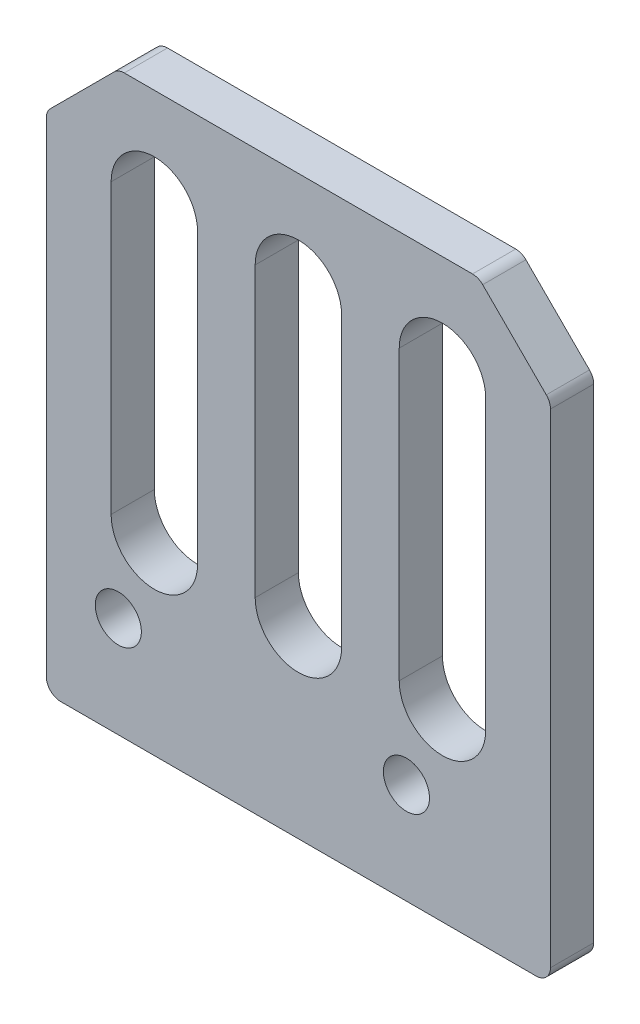
ISO-10303-21;
HEADER;
FILE_DESCRIPTION(('STEP AP214'),'2;1');
FILE_NAME('part.step','',(''),(''),'','','');
FILE_SCHEMA(('AUTOMOTIVE_DESIGN { 1 0 10303 214 1 1 1 1 }'));
ENDSEC;
DATA;
#1=APPLICATION_CONTEXT('core data for automotive mechanical design processes');
#2=APPLICATION_PROTOCOL_DEFINITION('international standard','automotive_design',2000,#1);
#3=PRODUCT_CONTEXT('',#1,'mechanical');
#4=PRODUCT('Part','Part','',(#3));
#5=PRODUCT_RELATED_PRODUCT_CATEGORY('part','',(#4));
#6=PRODUCT_DEFINITION_FORMATION('','',#4);
#7=PRODUCT_DEFINITION_CONTEXT('part definition',#1,'design');
#8=PRODUCT_DEFINITION('design','',#6,#7);
#9=PRODUCT_DEFINITION_SHAPE('','',#8);
#10=(LENGTH_UNIT() NAMED_UNIT(*) SI_UNIT(.MILLI.,.METRE.));
#11=(NAMED_UNIT(*) PLANE_ANGLE_UNIT() SI_UNIT($,.RADIAN.));
#12=(NAMED_UNIT(*) SI_UNIT($,.STERADIAN.) SOLID_ANGLE_UNIT());
#13=UNCERTAINTY_MEASURE_WITH_UNIT(LENGTH_MEASURE(1.E-05),#10,'distance_accuracy_value','');
#14=(GEOMETRIC_REPRESENTATION_CONTEXT(3) GLOBAL_UNCERTAINTY_ASSIGNED_CONTEXT((#13)) GLOBAL_UNIT_ASSIGNED_CONTEXT((#10,
#11,#12)) REPRESENTATION_CONTEXT('',''));
#15=CARTESIAN_POINT('',(0.,0.,0.));
#16=DIRECTION('',(0.,0.,1.));
#17=DIRECTION('',(1.,0.,0.));
#18=AXIS2_PLACEMENT_3D('',#15,#16,#17);
#19=CARTESIAN_POINT('',(17.5,20.,3.));
#20=DIRECTION('',(-1.,0.,0.));
#21=DIRECTION('',(0.,-1.,0.));
#22=AXIS2_PLACEMENT_3D('',#19,#20,#21);
#23=PLANE('',#22);
#24=DIRECTION('',(0.,1.,0.));
#25=VECTOR('',#24,1.);
#26=CARTESIAN_POINT('',(17.5,20.,0.));
#27=LINE('',#26,#25);
#28=CARTESIAN_POINT('',(17.5,-19.,0.));
#29=VERTEX_POINT('',#28);
#30=CARTESIAN_POINT('',(17.5,14.5857864376269,0.));
#31=VERTEX_POINT('',#30);
#32=EDGE_CURVE('E344',#29,#31,#27,.T.);
#33=ORIENTED_EDGE('',*,*,#32,.T.);
#34=DIRECTION('',(0.,0.,-1.));
#35=VECTOR('',#34,1.);
#36=CARTESIAN_POINT('',(17.5,14.5857864376269,3.));
#37=LINE('',#36,#35);
#38=CARTESIAN_POINT('',(17.5,14.5857864376269,3.));
#39=VERTEX_POINT('',#38);
#40=EDGE_CURVE('E457',#31,#39,#37,.F.);
#41=ORIENTED_EDGE('',*,*,#40,.T.);
#42=DIRECTION('',(0.,1.,0.));
#43=VECTOR('',#42,1.);
#44=CARTESIAN_POINT('',(17.5,20.,3.));
#45=LINE('',#44,#43);
#46=CARTESIAN_POINT('',(17.5,-19.,3.));
#47=VERTEX_POINT('',#46);
#48=EDGE_CURVE('E356',#47,#39,#45,.T.);
#49=ORIENTED_EDGE('',*,*,#48,.F.);
#50=DIRECTION('',(0.,0.,-1.));
#51=VECTOR('',#50,1.);
#52=CARTESIAN_POINT('',(17.5,-19.,3.));
#53=LINE('',#52,#51);
#54=EDGE_CURVE('E453',#47,#29,#53,.T.);
#55=ORIENTED_EDGE('',*,*,#54,.T.);
#56=EDGE_LOOP('',(#33,#41,#49,#55));
#57=FACE_BOUND('',#56,.T.);
#58=ADVANCED_FACE('F40',(#57),#23,.F.);
#59=CARTESIAN_POINT('',(-17.5,20.,3.));
#60=DIRECTION('',(0.,-1.,0.));
#61=DIRECTION('',(0.,0.,-1.));
#62=AXIS2_PLACEMENT_3D('',#59,#60,#61);
#63=PLANE('',#62);
#64=DIRECTION('',(-1.,0.,0.));
#65=VECTOR('',#64,1.);
#66=CARTESIAN_POINT('',(-17.5,20.,3.));
#67=LINE('',#66,#65);
#68=CARTESIAN_POINT('',(12.0857864376269,20.,3.));
#69=VERTEX_POINT('',#68);
#70=CARTESIAN_POINT('',(-12.0857864376269,20.,3.));
#71=VERTEX_POINT('',#70);
#72=EDGE_CURVE('E360',#69,#71,#67,.T.);
#73=ORIENTED_EDGE('',*,*,#72,.F.);
#74=DIRECTION('',(0.,0.,1.));
#75=VECTOR('',#74,1.);
#76=CARTESIAN_POINT('',(12.0857864376269,20.,0.));
#77=LINE('',#76,#75);
#78=CARTESIAN_POINT('',(12.0857864376269,20.,0.));
#79=VERTEX_POINT('',#78);
#80=EDGE_CURVE('E407',#69,#79,#77,.F.);
#81=ORIENTED_EDGE('',*,*,#80,.T.);
#82=DIRECTION('',(-1.,0.,0.));
#83=VECTOR('',#82,1.);
#84=CARTESIAN_POINT('',(-17.5,20.,0.));
#85=LINE('',#84,#83);
#86=CARTESIAN_POINT('',(-12.0857864376269,20.,0.));
#87=VERTEX_POINT('',#86);
#88=EDGE_CURVE('E377',#79,#87,#85,.T.);
#89=ORIENTED_EDGE('',*,*,#88,.T.);
#90=DIRECTION('',(0.,0.,-1.));
#91=VECTOR('',#90,1.);
#92=CARTESIAN_POINT('',(-12.0857864376269,20.,3.));
#93=LINE('',#92,#91);
#94=EDGE_CURVE('E403',#87,#71,#93,.F.);
#95=ORIENTED_EDGE('',*,*,#94,.T.);
#96=EDGE_LOOP('',(#73,#81,#89,#95));
#97=FACE_BOUND('',#96,.T.);
#98=ADVANCED_FACE('F491',(#97),#63,.F.);
#99=CARTESIAN_POINT('',(-17.5,20.,3.));
#100=DIRECTION('',(1.,0.,0.));
#101=DIRECTION('',(0.,1.,0.));
#102=AXIS2_PLACEMENT_3D('',#99,#100,#101);
#103=PLANE('',#102);
#104=DIRECTION('',(0.,-1.,0.));
#105=VECTOR('',#104,1.);
#106=CARTESIAN_POINT('',(-17.5,20.,3.));
#107=LINE('',#106,#105);
#108=CARTESIAN_POINT('',(-17.5,14.5857864376269,3.));
#109=VERTEX_POINT('',#108);
#110=CARTESIAN_POINT('',(-17.5,-19.,3.));
#111=VERTEX_POINT('',#110);
#112=EDGE_CURVE('E365',#109,#111,#107,.T.);
#113=ORIENTED_EDGE('',*,*,#112,.F.);
#114=DIRECTION('',(0.,0.,1.));
#115=VECTOR('',#114,1.);
#116=CARTESIAN_POINT('',(-17.5,14.5857864376269,0.));
#117=LINE('',#116,#115);
#118=CARTESIAN_POINT('',(-17.5,14.5857864376269,0.));
#119=VERTEX_POINT('',#118);
#120=EDGE_CURVE('E471',#109,#119,#117,.F.);
#121=ORIENTED_EDGE('',*,*,#120,.T.);
#122=DIRECTION('',(0.,-1.,0.));
#123=VECTOR('',#122,1.);
#124=CARTESIAN_POINT('',(-17.5,20.,0.));
#125=LINE('',#124,#123);
#126=CARTESIAN_POINT('',(-17.5,-19.,0.));
#127=VERTEX_POINT('',#126);
#128=EDGE_CURVE('E381',#119,#127,#125,.T.);
#129=ORIENTED_EDGE('',*,*,#128,.T.);
#130=DIRECTION('',(0.,0.,-1.));
#131=VECTOR('',#130,1.);
#132=CARTESIAN_POINT('',(-17.5,-19.,3.));
#133=LINE('',#132,#131);
#134=EDGE_CURVE('E468',#127,#111,#133,.F.);
#135=ORIENTED_EDGE('',*,*,#134,.T.);
#136=EDGE_LOOP('',(#113,#121,#129,#135));
#137=FACE_BOUND('',#136,.T.);
#138=ADVANCED_FACE('F526',(#137),#103,.F.);
#139=CARTESIAN_POINT('',(-17.5,-20.,3.));
#140=DIRECTION('',(0.,1.,0.));
#141=DIRECTION('',(0.,0.,1.));
#142=AXIS2_PLACEMENT_3D('',#139,#140,#141);
#143=PLANE('',#142);
#144=DIRECTION('',(1.,0.,0.));
#145=VECTOR('',#144,1.);
#146=CARTESIAN_POINT('',(-17.5,-20.,0.));
#147=LINE('',#146,#145);
#148=CARTESIAN_POINT('',(-16.5,-20.,0.));
#149=VERTEX_POINT('',#148);
#150=CARTESIAN_POINT('',(16.5,-20.,0.));
#151=VERTEX_POINT('',#150);
#152=EDGE_CURVE('E361',#149,#151,#147,.T.);
#153=ORIENTED_EDGE('',*,*,#152,.T.);
#154=DIRECTION('',(0.,0.,-1.));
#155=VECTOR('',#154,1.);
#156=CARTESIAN_POINT('',(16.5,-20.,3.));
#157=LINE('',#156,#155);
#158=CARTESIAN_POINT('',(16.5,-20.,3.));
#159=VERTEX_POINT('',#158);
#160=EDGE_CURVE('E465',#151,#159,#157,.F.);
#161=ORIENTED_EDGE('',*,*,#160,.T.);
#162=DIRECTION('',(1.,0.,0.));
#163=VECTOR('',#162,1.);
#164=CARTESIAN_POINT('',(-17.5,-20.,3.));
#165=LINE('',#164,#163);
#166=CARTESIAN_POINT('',(-16.5,-20.,3.));
#167=VERTEX_POINT('',#166);
#168=EDGE_CURVE('E369',#167,#159,#165,.T.);
#169=ORIENTED_EDGE('',*,*,#168,.F.);
#170=DIRECTION('',(0.,0.,-1.));
#171=VECTOR('',#170,1.);
#172=CARTESIAN_POINT('',(-16.5,-20.,3.));
#173=LINE('',#172,#171);
#174=EDGE_CURVE('E461',#167,#149,#173,.T.);
#175=ORIENTED_EDGE('',*,*,#174,.T.);
#176=EDGE_LOOP('',(#153,#161,#169,#175));
#177=FACE_BOUND('',#176,.T.);
#178=ADVANCED_FACE('F518',(#177),#143,.F.);
#179=CARTESIAN_POINT('',(0.,0.,3.));
#180=DIRECTION('',(0.,0.,1.));
#181=DIRECTION('',(1.,0.,0.));
#182=AXIS2_PLACEMENT_3D('',#179,#180,#181);
#183=PLANE('',#182);
#184=CARTESIAN_POINT('',(10.,13.,3.));
#185=DIRECTION('',(0.,0.,1.));
#186=DIRECTION('',(1.,0.,0.));
#187=AXIS2_PLACEMENT_3D('',#184,#185,#186);
#188=CIRCLE('',#187,3.00000000000001);
#189=CARTESIAN_POINT('',(13.,13.,3.));
#190=VERTEX_POINT('',#189);
#191=CARTESIAN_POINT('',(6.99999999999999,13.,3.));
#192=VERTEX_POINT('',#191);
#193=EDGE_CURVE('E56',#190,#192,#188,.T.);
#194=ORIENTED_EDGE('',*,*,#193,.F.);
#195=DIRECTION('',(0.,1.,0.));
#196=VECTOR('',#195,1.);
#197=CARTESIAN_POINT('',(13.,13.,3.));
#198=LINE('',#197,#196);
#199=CARTESIAN_POINT('',(13.,-7.,3.));
#200=VERTEX_POINT('',#199);
#201=EDGE_CURVE('E260',#200,#190,#198,.T.);
#202=ORIENTED_EDGE('',*,*,#201,.F.);
#203=CARTESIAN_POINT('',(10.,-7.,3.));
#204=DIRECTION('',(0.,0.,1.));
#205=DIRECTION('',(1.,0.,0.));
#206=AXIS2_PLACEMENT_3D('',#203,#204,#205);
#207=CIRCLE('',#206,3.00000000000001);
#208=CARTESIAN_POINT('',(6.99999999999999,-7.,3.));
#209=VERTEX_POINT('',#208);
#210=EDGE_CURVE('E279',#209,#200,#207,.T.);
#211=ORIENTED_EDGE('',*,*,#210,.F.);
#212=DIRECTION('',(0.,-1.,0.));
#213=VECTOR('',#212,1.);
#214=CARTESIAN_POINT('',(6.99999999999999,13.,3.));
#215=LINE('',#214,#213);
#216=EDGE_CURVE('E275',#192,#209,#215,.T.);
#217=ORIENTED_EDGE('',*,*,#216,.F.);
#218=EDGE_LOOP('',(#194,#202,#211,#217));
#219=FACE_BOUND('',#218,.T.);
#220=CARTESIAN_POINT('',(-10.,13.,3.));
#221=DIRECTION('',(0.,0.,1.));
#222=DIRECTION('',(1.,0.,0.));
#223=AXIS2_PLACEMENT_3D('',#220,#221,#222);
#224=CIRCLE('',#223,3.);
#225=CARTESIAN_POINT('',(-7.,13.,3.));
#226=VERTEX_POINT('',#225);
#227=CARTESIAN_POINT('',(-13.,13.,3.));
#228=VERTEX_POINT('',#227);
#229=EDGE_CURVE('E64',#226,#228,#224,.T.);
#230=ORIENTED_EDGE('',*,*,#229,.F.);
#231=DIRECTION('',(0.,1.,0.));
#232=VECTOR('',#231,1.);
#233=CARTESIAN_POINT('',(-7.,13.,3.));
#234=LINE('',#233,#232);
#235=CARTESIAN_POINT('',(-7.,-7.,3.));
#236=VERTEX_POINT('',#235);
#237=EDGE_CURVE('E225',#236,#226,#234,.T.);
#238=ORIENTED_EDGE('',*,*,#237,.F.);
#239=CARTESIAN_POINT('',(-10.,-7.,3.));
#240=DIRECTION('',(0.,0.,1.));
#241=DIRECTION('',(1.,0.,0.));
#242=AXIS2_PLACEMENT_3D('',#239,#240,#241);
#243=CIRCLE('',#242,3.);
#244=CARTESIAN_POINT('',(-13.,-7.,3.));
#245=VERTEX_POINT('',#244);
#246=EDGE_CURVE('E230',#245,#236,#243,.T.);
#247=ORIENTED_EDGE('',*,*,#246,.F.);
#248=DIRECTION('',(0.,-1.,0.));
#249=VECTOR('',#248,1.);
#250=CARTESIAN_POINT('',(-13.,13.,3.));
#251=LINE('',#250,#249);
#252=EDGE_CURVE('E239',#228,#245,#251,.T.);
#253=ORIENTED_EDGE('',*,*,#252,.F.);
#254=EDGE_LOOP('',(#230,#238,#247,#253));
#255=FACE_BOUND('',#254,.T.);
#256=CARTESIAN_POINT('',(0.,13.,3.));
#257=DIRECTION('',(0.,0.,1.));
#258=DIRECTION('',(1.,0.,0.));
#259=AXIS2_PLACEMENT_3D('',#256,#257,#258);
#260=CIRCLE('',#259,3.);
#261=CARTESIAN_POINT('',(3.,13.,3.));
#262=VERTEX_POINT('',#261);
#263=CARTESIAN_POINT('',(-3.,13.,3.));
#264=VERTEX_POINT('',#263);
#265=EDGE_CURVE('E249',#262,#264,#260,.T.);
#266=ORIENTED_EDGE('',*,*,#265,.F.);
#267=DIRECTION('',(0.,1.,0.));
#268=VECTOR('',#267,1.);
#269=CARTESIAN_POINT('',(3.,13.,3.));
#270=LINE('',#269,#268);
#271=CARTESIAN_POINT('',(3.,-7.,3.));
#272=VERTEX_POINT('',#271);
#273=EDGE_CURVE('E301',#272,#262,#270,.T.);
#274=ORIENTED_EDGE('',*,*,#273,.F.);
#275=CARTESIAN_POINT('',(0.,-7.,3.));
#276=DIRECTION('',(0.,0.,1.));
#277=DIRECTION('',(1.,0.,0.));
#278=AXIS2_PLACEMENT_3D('',#275,#276,#277);
#279=CIRCLE('',#278,3.);
#280=CARTESIAN_POINT('',(-3.,-7.,3.));
#281=VERTEX_POINT('',#280);
#282=EDGE_CURVE('E320',#281,#272,#279,.T.);
#283=ORIENTED_EDGE('',*,*,#282,.F.);
#284=DIRECTION('',(0.,-1.,0.));
#285=VECTOR('',#284,1.);
#286=CARTESIAN_POINT('',(-3.,13.,3.));
#287=LINE('',#286,#285);
#288=EDGE_CURVE('E316',#264,#281,#287,.T.);
#289=ORIENTED_EDGE('',*,*,#288,.F.);
#290=EDGE_LOOP('',(#266,#274,#283,#289));
#291=FACE_BOUND('',#290,.T.);
#292=CARTESIAN_POINT('',(-12.5,-13.,3.));
#293=DIRECTION('',(0.,0.,1.));
#294=DIRECTION('',(1.,0.,0.));
#295=AXIS2_PLACEMENT_3D('',#292,#293,#294);
#296=CIRCLE('',#295,1.6);
#297=CARTESIAN_POINT('',(-10.9,-13.,3.));
#298=VERTEX_POINT('',#297);
#299=EDGE_CURVE('E345',#298,#298,#296,.T.);
#300=ORIENTED_EDGE('',*,*,#299,.F.);
#301=EDGE_LOOP('',(#300));
#302=FACE_BOUND('',#301,.T.);
#303=CARTESIAN_POINT('',(7.5,-13.,3.));
#304=DIRECTION('',(0.,0.,1.));
#305=DIRECTION('',(1.,0.,0.));
#306=AXIS2_PLACEMENT_3D('',#303,#304,#305);
#307=CIRCLE('',#306,1.6);
#308=CARTESIAN_POINT('',(9.1,-13.,3.));
#309=VERTEX_POINT('',#308);
#310=EDGE_CURVE('E330',#309,#309,#307,.T.);
#311=ORIENTED_EDGE('',*,*,#310,.F.);
#312=EDGE_LOOP('',(#311));
#313=FACE_BOUND('',#312,.T.);
#314=DIRECTION('',(0.707106781186546,-0.707106781186549,0.));
#315=VECTOR('',#314,1.);
#316=CARTESIAN_POINT('',(16.25,16.25,3.));
#317=LINE('',#316,#315);
#318=CARTESIAN_POINT('',(17.2071067811865,15.2928932188134,3.));
#319=VERTEX_POINT('',#318);
#320=CARTESIAN_POINT('',(12.7928932188135,19.7071067811865,3.));
#321=VERTEX_POINT('',#320);
#322=EDGE_CURVE('E395',#319,#321,#317,.F.);
#323=ORIENTED_EDGE('',*,*,#322,.T.);
#324=CARTESIAN_POINT('',(12.0857864376269,19.,3.));
#325=DIRECTION('',(0.,0.,1.));
#326=DIRECTION('',(1.,0.,0.));
#327=AXIS2_PLACEMENT_3D('',#324,#325,#326);
#328=CIRCLE('',#327,1.);
#329=EDGE_CURVE('E450',#321,#69,#328,.T.);
#330=ORIENTED_EDGE('',*,*,#329,.T.);
#331=ORIENTED_EDGE('',*,*,#72,.T.);
#332=CARTESIAN_POINT('',(-12.0857864376269,19.,3.));
#333=DIRECTION('',(0.,0.,1.));
#334=DIRECTION('',(1.,0.,0.));
#335=AXIS2_PLACEMENT_3D('',#332,#333,#334);
#336=CIRCLE('',#335,1.);
#337=CARTESIAN_POINT('',(-12.7928932188134,19.7071067811865,3.));
#338=VERTEX_POINT('',#337);
#339=EDGE_CURVE('E438',#71,#338,#336,.T.);
#340=ORIENTED_EDGE('',*,*,#339,.T.);
#341=DIRECTION('',(0.707106781186549,0.707106781186546,0.));
#342=VECTOR('',#341,1.);
#343=CARTESIAN_POINT('',(-16.25,16.25,3.));
#344=LINE('',#343,#342);
#345=CARTESIAN_POINT('',(-17.2071067811865,15.2928932188134,3.));
#346=VERTEX_POINT('',#345);
#347=EDGE_CURVE('E399',#338,#346,#344,.F.);
#348=ORIENTED_EDGE('',*,*,#347,.T.);
#349=CARTESIAN_POINT('',(-16.5,14.5857864376269,3.));
#350=DIRECTION('',(0.,0.,1.));
#351=DIRECTION('',(1.,0.,0.));
#352=AXIS2_PLACEMENT_3D('',#349,#350,#351);
#353=CIRCLE('',#352,1.);
#354=EDGE_CURVE('E441',#346,#109,#353,.T.);
#355=ORIENTED_EDGE('',*,*,#354,.T.);
#356=ORIENTED_EDGE('',*,*,#112,.T.);
#357=CARTESIAN_POINT('',(-16.5,-19.,3.));
#358=DIRECTION('',(0.,0.,1.));
#359=DIRECTION('',(1.,0.,0.));
#360=AXIS2_PLACEMENT_3D('',#357,#358,#359);
#361=CIRCLE('',#360,1.);
#362=EDGE_CURVE('E435',#111,#167,#361,.T.);
#363=ORIENTED_EDGE('',*,*,#362,.T.);
#364=ORIENTED_EDGE('',*,*,#168,.T.);
#365=CARTESIAN_POINT('',(16.5,-19.,3.));
#366=DIRECTION('',(0.,0.,1.));
#367=DIRECTION('',(1.,0.,0.));
#368=AXIS2_PLACEMENT_3D('',#365,#366,#367);
#369=CIRCLE('',#368,1.);
#370=EDGE_CURVE('E444',#159,#47,#369,.T.);
#371=ORIENTED_EDGE('',*,*,#370,.T.);
#372=ORIENTED_EDGE('',*,*,#48,.T.);
#373=CARTESIAN_POINT('',(16.5,14.5857864376269,3.));
#374=DIRECTION('',(0.,0.,1.));
#375=DIRECTION('',(1.,0.,0.));
#376=AXIS2_PLACEMENT_3D('',#373,#374,#375);
#377=CIRCLE('',#376,1.);
#378=EDGE_CURVE('E447',#39,#319,#377,.T.);
#379=ORIENTED_EDGE('',*,*,#378,.T.);
#380=EDGE_LOOP('',(#323,#330,#331,#340,#348,#355,#356,#363,#364,#371,#372,#379));
#381=FACE_BOUND('',#380,.T.);
#382=ADVANCED_FACE('F494',(#219,#255,#291,#302,#313,#381),#183,.T.);
#383=CARTESIAN_POINT('',(0.,0.,0.));
#384=DIRECTION('',(0.,0.,1.));
#385=DIRECTION('',(1.,0.,0.));
#386=AXIS2_PLACEMENT_3D('',#383,#384,#385);
#387=PLANE('',#386);
#388=DIRECTION('',(0.,1.,0.));
#389=VECTOR('',#388,1.);
#390=CARTESIAN_POINT('',(13.,13.,0.));
#391=LINE('',#390,#389);
#392=CARTESIAN_POINT('',(13.,-7.,0.));
#393=VERTEX_POINT('',#392);
#394=CARTESIAN_POINT('',(13.,13.,0.));
#395=VERTEX_POINT('',#394);
#396=EDGE_CURVE('E268',#393,#395,#391,.T.);
#397=ORIENTED_EDGE('',*,*,#396,.T.);
#398=CARTESIAN_POINT('',(10.,13.,0.));
#399=DIRECTION('',(0.,0.,1.));
#400=DIRECTION('',(1.,0.,0.));
#401=AXIS2_PLACEMENT_3D('',#398,#399,#400);
#402=CIRCLE('',#401,3.00000000000001);
#403=CARTESIAN_POINT('',(6.99999999999999,13.,0.));
#404=VERTEX_POINT('',#403);
#405=EDGE_CURVE('E255',#395,#404,#402,.T.);
#406=ORIENTED_EDGE('',*,*,#405,.T.);
#407=DIRECTION('',(0.,-1.,0.));
#408=VECTOR('',#407,1.);
#409=CARTESIAN_POINT('',(6.99999999999999,13.,0.));
#410=LINE('',#409,#408);
#411=CARTESIAN_POINT('',(6.99999999999999,-7.,0.));
#412=VERTEX_POINT('',#411);
#413=EDGE_CURVE('E259',#404,#412,#410,.T.);
#414=ORIENTED_EDGE('',*,*,#413,.T.);
#415=CARTESIAN_POINT('',(10.,-7.,0.));
#416=DIRECTION('',(0.,0.,1.));
#417=DIRECTION('',(1.,0.,0.));
#418=AXIS2_PLACEMENT_3D('',#415,#416,#417);
#419=CIRCLE('',#418,3.00000000000001);
#420=EDGE_CURVE('E264',#412,#393,#419,.T.);
#421=ORIENTED_EDGE('',*,*,#420,.T.);
#422=EDGE_LOOP('',(#397,#406,#414,#421));
#423=FACE_BOUND('',#422,.T.);
#424=DIRECTION('',(0.,1.,0.));
#425=VECTOR('',#424,1.);
#426=CARTESIAN_POINT('',(-7.,13.,0.));
#427=LINE('',#426,#425);
#428=CARTESIAN_POINT('',(-7.,-7.,0.));
#429=VERTEX_POINT('',#428);
#430=CARTESIAN_POINT('',(-7.,13.,0.));
#431=VERTEX_POINT('',#430);
#432=EDGE_CURVE('E210',#429,#431,#427,.T.);
#433=ORIENTED_EDGE('',*,*,#432,.T.);
#434=CARTESIAN_POINT('',(-10.,13.,0.));
#435=DIRECTION('',(0.,0.,1.));
#436=DIRECTION('',(1.,0.,0.));
#437=AXIS2_PLACEMENT_3D('',#434,#435,#436);
#438=CIRCLE('',#437,3.);
#439=CARTESIAN_POINT('',(-13.,13.,0.));
#440=VERTEX_POINT('',#439);
#441=EDGE_CURVE('E203',#431,#440,#438,.T.);
#442=ORIENTED_EDGE('',*,*,#441,.T.);
#443=DIRECTION('',(0.,-1.,0.));
#444=VECTOR('',#443,1.);
#445=CARTESIAN_POINT('',(-13.,13.,0.));
#446=LINE('',#445,#444);
#447=CARTESIAN_POINT('',(-13.,-7.,0.));
#448=VERTEX_POINT('',#447);
#449=EDGE_CURVE('E214',#440,#448,#446,.T.);
#450=ORIENTED_EDGE('',*,*,#449,.T.);
#451=CARTESIAN_POINT('',(-10.,-7.,0.));
#452=DIRECTION('',(0.,0.,1.));
#453=DIRECTION('',(1.,0.,0.));
#454=AXIS2_PLACEMENT_3D('',#451,#452,#453);
#455=CIRCLE('',#454,3.);
#456=EDGE_CURVE('E219',#448,#429,#455,.T.);
#457=ORIENTED_EDGE('',*,*,#456,.T.);
#458=EDGE_LOOP('',(#433,#442,#450,#457));
#459=FACE_BOUND('',#458,.T.);
#460=DIRECTION('',(0.,1.,0.));
#461=VECTOR('',#460,1.);
#462=CARTESIAN_POINT('',(3.,13.,0.));
#463=LINE('',#462,#461);
#464=CARTESIAN_POINT('',(3.,-7.,0.));
#465=VERTEX_POINT('',#464);
#466=CARTESIAN_POINT('',(3.,13.,0.));
#467=VERTEX_POINT('',#466);
#468=EDGE_CURVE('E309',#465,#467,#463,.T.);
#469=ORIENTED_EDGE('',*,*,#468,.T.);
#470=CARTESIAN_POINT('',(0.,13.,0.));
#471=DIRECTION('',(0.,0.,1.));
#472=DIRECTION('',(1.,0.,0.));
#473=AXIS2_PLACEMENT_3D('',#470,#471,#472);
#474=CIRCLE('',#473,3.);
#475=CARTESIAN_POINT('',(-3.,13.,0.));
#476=VERTEX_POINT('',#475);
#477=EDGE_CURVE('E296',#467,#476,#474,.T.);
#478=ORIENTED_EDGE('',*,*,#477,.T.);
#479=DIRECTION('',(0.,-1.,0.));
#480=VECTOR('',#479,1.);
#481=CARTESIAN_POINT('',(-3.,13.,0.));
#482=LINE('',#481,#480);
#483=CARTESIAN_POINT('',(-3.,-7.,0.));
#484=VERTEX_POINT('',#483);
#485=EDGE_CURVE('E300',#476,#484,#482,.T.);
#486=ORIENTED_EDGE('',*,*,#485,.T.);
#487=CARTESIAN_POINT('',(0.,-7.,0.));
#488=DIRECTION('',(0.,0.,1.));
#489=DIRECTION('',(1.,0.,0.));
#490=AXIS2_PLACEMENT_3D('',#487,#488,#489);
#491=CIRCLE('',#490,3.);
#492=EDGE_CURVE('E305',#484,#465,#491,.T.);
#493=ORIENTED_EDGE('',*,*,#492,.T.);
#494=EDGE_LOOP('',(#469,#478,#486,#493));
#495=FACE_BOUND('',#494,.T.);
#496=CARTESIAN_POINT('',(-12.5,-13.,0.));
#497=DIRECTION('',(0.,0.,1.));
#498=DIRECTION('',(1.,0.,0.));
#499=AXIS2_PLACEMENT_3D('',#496,#497,#498);
#500=CIRCLE('',#499,1.6);
#501=CARTESIAN_POINT('',(-10.9,-13.,0.));
#502=VERTEX_POINT('',#501);
#503=EDGE_CURVE('E340',#502,#502,#500,.T.);
#504=ORIENTED_EDGE('',*,*,#503,.T.);
#505=EDGE_LOOP('',(#504));
#506=FACE_BOUND('',#505,.T.);
#507=CARTESIAN_POINT('',(7.5,-13.,0.));
#508=DIRECTION('',(0.,0.,1.));
#509=DIRECTION('',(1.,0.,0.));
#510=AXIS2_PLACEMENT_3D('',#507,#508,#509);
#511=CIRCLE('',#510,1.6);
#512=CARTESIAN_POINT('',(9.1,-13.,0.));
#513=VERTEX_POINT('',#512);
#514=EDGE_CURVE('E349',#513,#513,#511,.T.);
#515=ORIENTED_EDGE('',*,*,#514,.T.);
#516=EDGE_LOOP('',(#515));
#517=FACE_BOUND('',#516,.T.);
#518=ORIENTED_EDGE('',*,*,#88,.F.);
#519=CARTESIAN_POINT('',(12.0857864376269,19.,0.));
#520=DIRECTION('',(0.,0.,1.));
#521=DIRECTION('',(1.,0.,0.));
#522=AXIS2_PLACEMENT_3D('',#519,#520,#521);
#523=CIRCLE('',#522,1.);
#524=CARTESIAN_POINT('',(12.7928932188135,19.7071067811865,0.));
#525=VERTEX_POINT('',#524);
#526=EDGE_CURVE('E426',#79,#525,#523,.F.);
#527=ORIENTED_EDGE('',*,*,#526,.T.);
#528=DIRECTION('',(-0.707106781186546,0.707106781186549,0.));
#529=VECTOR('',#528,1.);
#530=CARTESIAN_POINT('',(12.5,20.,0.));
#531=LINE('',#530,#529);
#532=CARTESIAN_POINT('',(17.2071067811865,15.2928932188134,0.));
#533=VERTEX_POINT('',#532);
#534=EDGE_CURVE('E373',#525,#533,#531,.F.);
#535=ORIENTED_EDGE('',*,*,#534,.T.);
#536=CARTESIAN_POINT('',(16.5,14.5857864376269,0.));
#537=DIRECTION('',(0.,0.,1.));
#538=DIRECTION('',(1.,0.,0.));
#539=AXIS2_PLACEMENT_3D('',#536,#537,#538);
#540=CIRCLE('',#539,1.);
#541=EDGE_CURVE('E423',#533,#31,#540,.F.);
#542=ORIENTED_EDGE('',*,*,#541,.T.);
#543=ORIENTED_EDGE('',*,*,#32,.F.);
#544=CARTESIAN_POINT('',(16.5,-19.,0.));
#545=DIRECTION('',(0.,0.,1.));
#546=DIRECTION('',(1.,0.,0.));
#547=AXIS2_PLACEMENT_3D('',#544,#545,#546);
#548=CIRCLE('',#547,1.);
#549=EDGE_CURVE('E420',#29,#151,#548,.F.);
#550=ORIENTED_EDGE('',*,*,#549,.T.);
#551=ORIENTED_EDGE('',*,*,#152,.F.);
#552=CARTESIAN_POINT('',(-16.5,-19.,0.));
#553=DIRECTION('',(0.,0.,1.));
#554=DIRECTION('',(1.,0.,0.));
#555=AXIS2_PLACEMENT_3D('',#552,#553,#554);
#556=CIRCLE('',#555,1.);
#557=EDGE_CURVE('E411',#149,#127,#556,.F.);
#558=ORIENTED_EDGE('',*,*,#557,.T.);
#559=ORIENTED_EDGE('',*,*,#128,.F.);
#560=CARTESIAN_POINT('',(-16.5,14.5857864376269,0.));
#561=DIRECTION('',(0.,0.,1.));
#562=DIRECTION('',(1.,0.,0.));
#563=AXIS2_PLACEMENT_3D('',#560,#561,#562);
#564=CIRCLE('',#563,1.);
#565=CARTESIAN_POINT('',(-17.2071067811865,15.2928932188134,0.));
#566=VERTEX_POINT('',#565);
#567=EDGE_CURVE('E417',#119,#566,#564,.F.);
#568=ORIENTED_EDGE('',*,*,#567,.T.);
#569=DIRECTION('',(-0.707106781186549,-0.707106781186546,0.));
#570=VECTOR('',#569,1.);
#571=CARTESIAN_POINT('',(-17.5,15.,0.));
#572=LINE('',#571,#570);
#573=CARTESIAN_POINT('',(-12.7928932188134,19.7071067811865,0.));
#574=VERTEX_POINT('',#573);
#575=EDGE_CURVE('E391',#566,#574,#572,.F.);
#576=ORIENTED_EDGE('',*,*,#575,.T.);
#577=CARTESIAN_POINT('',(-12.0857864376269,19.,0.));
#578=DIRECTION('',(0.,0.,1.));
#579=DIRECTION('',(1.,0.,0.));
#580=AXIS2_PLACEMENT_3D('',#577,#578,#579);
#581=CIRCLE('',#580,1.);
#582=EDGE_CURVE('E414',#574,#87,#581,.F.);
#583=ORIENTED_EDGE('',*,*,#582,.T.);
#584=EDGE_LOOP('',(#518,#527,#535,#542,#543,#550,#551,#558,#559,#568,#576,#583));
#585=FACE_BOUND('',#584,.T.);
#586=ADVANCED_FACE('F221',(#423,#459,#495,#506,#517,#585),#387,.F.);
#587=CARTESIAN_POINT('',(-17.5,15.,3.));
#588=DIRECTION('',(0.707106781186546,-0.707106781186549,0.));
#589=DIRECTION('',(0.,0.,-1.));
#590=AXIS2_PLACEMENT_3D('',#587,#588,#589);
#591=PLANE('',#590);
#592=ORIENTED_EDGE('',*,*,#575,.F.);
#593=DIRECTION('',(0.,0.,-1.));
#594=VECTOR('',#593,1.);
#595=CARTESIAN_POINT('',(-17.2071067811865,15.2928932188134,3.));
#596=LINE('',#595,#594);
#597=EDGE_CURVE('E11',#566,#346,#596,.F.);
#598=ORIENTED_EDGE('',*,*,#597,.T.);
#599=ORIENTED_EDGE('',*,*,#347,.F.);
#600=DIRECTION('',(0.,0.,1.));
#601=VECTOR('',#600,1.);
#602=CARTESIAN_POINT('',(-12.7928932188134,19.7071067811865,0.));
#603=LINE('',#602,#601);
#604=EDGE_CURVE('E49',#338,#574,#603,.F.);
#605=ORIENTED_EDGE('',*,*,#604,.T.);
#606=EDGE_LOOP('',(#592,#598,#599,#605));
#607=FACE_BOUND('',#606,.T.);
#608=ADVANCED_FACE('F480',(#607),#591,.F.);
#609=CARTESIAN_POINT('',(12.5,20.,3.));
#610=DIRECTION('',(-0.707106781186549,-0.707106781186546,0.));
#611=DIRECTION('',(0.,0.,-1.));
#612=AXIS2_PLACEMENT_3D('',#609,#610,#611);
#613=PLANE('',#612);
#614=ORIENTED_EDGE('',*,*,#534,.F.);
#615=DIRECTION('',(0.,0.,-1.));
#616=VECTOR('',#615,1.);
#617=CARTESIAN_POINT('',(12.7928932188135,19.7071067811865,3.));
#618=LINE('',#617,#616);
#619=EDGE_CURVE('E432',#525,#321,#618,.F.);
#620=ORIENTED_EDGE('',*,*,#619,.T.);
#621=ORIENTED_EDGE('',*,*,#322,.F.);
#622=DIRECTION('',(0.,0.,1.));
#623=VECTOR('',#622,1.);
#624=CARTESIAN_POINT('',(17.2071067811865,15.2928932188134,0.));
#625=LINE('',#624,#623);
#626=EDGE_CURVE('E429',#319,#533,#625,.F.);
#627=ORIENTED_EDGE('',*,*,#626,.T.);
#628=EDGE_LOOP('',(#614,#620,#621,#627));
#629=FACE_BOUND('',#628,.T.);
#630=ADVANCED_FACE('F503',(#629),#613,.F.);
#631=CARTESIAN_POINT('',(12.0857864376269,19.,3.));
#632=DIRECTION('',(0.,0.,-1.));
#633=DIRECTION('',(-1.,0.,0.));
#634=AXIS2_PLACEMENT_3D('',#631,#632,#633);
#635=CYLINDRICAL_SURFACE('',#634,1.);
#636=ORIENTED_EDGE('',*,*,#329,.F.);
#637=ORIENTED_EDGE('',*,*,#619,.F.);
#638=ORIENTED_EDGE('',*,*,#526,.F.);
#639=ORIENTED_EDGE('',*,*,#80,.F.);
#640=EDGE_LOOP('',(#636,#637,#638,#639));
#641=FACE_BOUND('',#640,.T.);
#642=ADVANCED_FACE('F499',(#641),#635,.T.);
#643=CARTESIAN_POINT('',(16.5,14.5857864376269,3.));
#644=DIRECTION('',(0.,0.,1.));
#645=DIRECTION('',(1.,0.,0.));
#646=AXIS2_PLACEMENT_3D('',#643,#644,#645);
#647=CYLINDRICAL_SURFACE('',#646,1.);
#648=ORIENTED_EDGE('',*,*,#541,.F.);
#649=ORIENTED_EDGE('',*,*,#626,.F.);
#650=ORIENTED_EDGE('',*,*,#378,.F.);
#651=ORIENTED_EDGE('',*,*,#40,.F.);
#652=EDGE_LOOP('',(#648,#649,#650,#651));
#653=FACE_BOUND('',#652,.T.);
#654=ADVANCED_FACE('F506',(#653),#647,.T.);
#655=CARTESIAN_POINT('',(16.5,-19.,3.));
#656=DIRECTION('',(0.,0.,-1.));
#657=DIRECTION('',(-1.,0.,0.));
#658=AXIS2_PLACEMENT_3D('',#655,#656,#657);
#659=CYLINDRICAL_SURFACE('',#658,1.);
#660=ORIENTED_EDGE('',*,*,#370,.F.);
#661=ORIENTED_EDGE('',*,*,#160,.F.);
#662=ORIENTED_EDGE('',*,*,#549,.F.);
#663=ORIENTED_EDGE('',*,*,#54,.F.);
#664=EDGE_LOOP('',(#660,#661,#662,#663));
#665=FACE_BOUND('',#664,.T.);
#666=ADVANCED_FACE('F514',(#665),#659,.T.);
#667=CARTESIAN_POINT('',(-16.5,14.5857864376269,3.));
#668=DIRECTION('',(0.,0.,-1.));
#669=DIRECTION('',(-1.,0.,0.));
#670=AXIS2_PLACEMENT_3D('',#667,#668,#669);
#671=CYLINDRICAL_SURFACE('',#670,1.);
#672=ORIENTED_EDGE('',*,*,#354,.F.);
#673=ORIENTED_EDGE('',*,*,#597,.F.);
#674=ORIENTED_EDGE('',*,*,#567,.F.);
#675=ORIENTED_EDGE('',*,*,#120,.F.);
#676=EDGE_LOOP('',(#672,#673,#674,#675));
#677=FACE_BOUND('',#676,.T.);
#678=ADVANCED_FACE('F530',(#677),#671,.T.);
#679=CARTESIAN_POINT('',(-12.0857864376269,19.,3.));
#680=DIRECTION('',(0.,0.,1.));
#681=DIRECTION('',(1.,0.,0.));
#682=AXIS2_PLACEMENT_3D('',#679,#680,#681);
#683=CYLINDRICAL_SURFACE('',#682,1.);
#684=ORIENTED_EDGE('',*,*,#582,.F.);
#685=ORIENTED_EDGE('',*,*,#604,.F.);
#686=ORIENTED_EDGE('',*,*,#339,.F.);
#687=ORIENTED_EDGE('',*,*,#94,.F.);
#688=EDGE_LOOP('',(#684,#685,#686,#687));
#689=FACE_BOUND('',#688,.T.);
#690=ADVANCED_FACE('F488',(#689),#683,.T.);
#691=CARTESIAN_POINT('',(-16.5,-19.,3.));
#692=DIRECTION('',(0.,0.,-1.));
#693=DIRECTION('',(-1.,0.,0.));
#694=AXIS2_PLACEMENT_3D('',#691,#692,#693);
#695=CYLINDRICAL_SURFACE('',#694,1.);
#696=ORIENTED_EDGE('',*,*,#362,.F.);
#697=ORIENTED_EDGE('',*,*,#134,.F.);
#698=ORIENTED_EDGE('',*,*,#557,.F.);
#699=ORIENTED_EDGE('',*,*,#174,.F.);
#700=EDGE_LOOP('',(#696,#697,#698,#699));
#701=FACE_BOUND('',#700,.T.);
#702=ADVANCED_FACE('F42',(#701),#695,.T.);
#703=CARTESIAN_POINT('',(7.5,-13.,0.));
#704=DIRECTION('',(0.,0.,1.));
#705=DIRECTION('',(1.,0.,0.));
#706=AXIS2_PLACEMENT_3D('',#703,#704,#705);
#707=CYLINDRICAL_SURFACE('',#706,1.6);
#708=ORIENTED_EDGE('',*,*,#514,.F.);
#709=EDGE_LOOP('',(#708));
#710=FACE_BOUND('',#709,.T.);
#711=ORIENTED_EDGE('',*,*,#310,.T.);
#712=EDGE_LOOP('',(#711));
#713=FACE_BOUND('',#712,.T.);
#714=ADVANCED_FACE('F586',(#710,#713),#707,.F.);
#715=CARTESIAN_POINT('',(-12.5,-13.,0.));
#716=DIRECTION('',(0.,0.,1.));
#717=DIRECTION('',(1.,0.,0.));
#718=AXIS2_PLACEMENT_3D('',#715,#716,#717);
#719=CYLINDRICAL_SURFACE('',#718,1.6);
#720=ORIENTED_EDGE('',*,*,#503,.F.);
#721=EDGE_LOOP('',(#720));
#722=FACE_BOUND('',#721,.T.);
#723=ORIENTED_EDGE('',*,*,#299,.T.);
#724=EDGE_LOOP('',(#723));
#725=FACE_BOUND('',#724,.T.);
#726=ADVANCED_FACE('F594',(#722,#725),#719,.F.);
#727=CARTESIAN_POINT('',(0.,13.,0.));
#728=DIRECTION('',(0.,0.,1.));
#729=DIRECTION('',(1.,0.,0.));
#730=AXIS2_PLACEMENT_3D('',#727,#728,#729);
#731=CYLINDRICAL_SURFACE('',#730,3.);
#732=ORIENTED_EDGE('',*,*,#265,.T.);
#733=DIRECTION('',(0.,0.,1.));
#734=VECTOR('',#733,1.);
#735=CARTESIAN_POINT('',(-3.,13.,0.));
#736=LINE('',#735,#734);
#737=EDGE_CURVE('E313',#476,#264,#736,.T.);
#738=ORIENTED_EDGE('',*,*,#737,.F.);
#739=ORIENTED_EDGE('',*,*,#477,.F.);
#740=DIRECTION('',(0.,0.,1.));
#741=VECTOR('',#740,1.);
#742=CARTESIAN_POINT('',(3.,13.,0.));
#743=LINE('',#742,#741);
#744=EDGE_CURVE('E327',#467,#262,#743,.T.);
#745=ORIENTED_EDGE('',*,*,#744,.T.);
#746=EDGE_LOOP('',(#732,#738,#739,#745));
#747=FACE_BOUND('',#746,.T.);
#748=ADVANCED_FACE('F604',(#747),#731,.F.);
#749=CARTESIAN_POINT('',(3.,13.,0.));
#750=DIRECTION('',(1.,0.,0.));
#751=DIRECTION('',(0.,1.,0.));
#752=AXIS2_PLACEMENT_3D('',#749,#750,#751);
#753=PLANE('',#752);
#754=ORIENTED_EDGE('',*,*,#273,.T.);
#755=ORIENTED_EDGE('',*,*,#744,.F.);
#756=ORIENTED_EDGE('',*,*,#468,.F.);
#757=DIRECTION('',(0.,0.,1.));
#758=VECTOR('',#757,1.);
#759=CARTESIAN_POINT('',(3.,-7.,0.));
#760=LINE('',#759,#758);
#761=EDGE_CURVE('E331',#465,#272,#760,.T.);
#762=ORIENTED_EDGE('',*,*,#761,.T.);
#763=EDGE_LOOP('',(#754,#755,#756,#762));
#764=FACE_BOUND('',#763,.T.);
#765=ADVANCED_FACE('F615',(#764),#753,.F.);
#766=CARTESIAN_POINT('',(0.,-7.,0.));
#767=DIRECTION('',(0.,0.,1.));
#768=DIRECTION('',(1.,0.,0.));
#769=AXIS2_PLACEMENT_3D('',#766,#767,#768);
#770=CYLINDRICAL_SURFACE('',#769,3.);
#771=ORIENTED_EDGE('',*,*,#282,.T.);
#772=ORIENTED_EDGE('',*,*,#761,.F.);
#773=ORIENTED_EDGE('',*,*,#492,.F.);
#774=DIRECTION('',(0.,0.,1.));
#775=VECTOR('',#774,1.);
#776=CARTESIAN_POINT('',(-3.,-7.,0.));
#777=LINE('',#776,#775);
#778=EDGE_CURVE('E334',#484,#281,#777,.T.);
#779=ORIENTED_EDGE('',*,*,#778,.T.);
#780=EDGE_LOOP('',(#771,#772,#773,#779));
#781=FACE_BOUND('',#780,.T.);
#782=ADVANCED_FACE('F626',(#781),#770,.F.);
#783=CARTESIAN_POINT('',(-3.,13.,0.));
#784=DIRECTION('',(-1.,0.,0.));
#785=DIRECTION('',(0.,-1.,0.));
#786=AXIS2_PLACEMENT_3D('',#783,#784,#785);
#787=PLANE('',#786);
#788=ORIENTED_EDGE('',*,*,#288,.T.);
#789=ORIENTED_EDGE('',*,*,#778,.F.);
#790=ORIENTED_EDGE('',*,*,#485,.F.);
#791=ORIENTED_EDGE('',*,*,#737,.T.);
#792=EDGE_LOOP('',(#788,#789,#790,#791));
#793=FACE_BOUND('',#792,.T.);
#794=ADVANCED_FACE('F636',(#793),#787,.F.);
#795=CARTESIAN_POINT('',(-10.,13.,0.));
#796=DIRECTION('',(0.,0.,1.));
#797=DIRECTION('',(1.,0.,0.));
#798=AXIS2_PLACEMENT_3D('',#795,#796,#797);
#799=CYLINDRICAL_SURFACE('',#798,3.);
#800=ORIENTED_EDGE('',*,*,#229,.T.);
#801=DIRECTION('',(0.,0.,1.));
#802=VECTOR('',#801,1.);
#803=CARTESIAN_POINT('',(-13.,13.,0.));
#804=LINE('',#803,#802);
#805=EDGE_CURVE('E199',#440,#228,#804,.T.);
#806=ORIENTED_EDGE('',*,*,#805,.F.);
#807=ORIENTED_EDGE('',*,*,#441,.F.);
#808=DIRECTION('',(0.,0.,1.));
#809=VECTOR('',#808,1.);
#810=CARTESIAN_POINT('',(-7.,13.,0.));
#811=LINE('',#810,#809);
#812=EDGE_CURVE('E246',#431,#226,#811,.T.);
#813=ORIENTED_EDGE('',*,*,#812,.T.);
#814=EDGE_LOOP('',(#800,#806,#807,#813));
#815=FACE_BOUND('',#814,.T.);
#816=ADVANCED_FACE('F201',(#815),#799,.F.);
#817=CARTESIAN_POINT('',(-7.,13.,0.));
#818=DIRECTION('',(1.,0.,0.));
#819=DIRECTION('',(0.,0.,-1.));
#820=AXIS2_PLACEMENT_3D('',#817,#818,#819);
#821=PLANE('',#820);
#822=ORIENTED_EDGE('',*,*,#237,.T.);
#823=ORIENTED_EDGE('',*,*,#812,.F.);
#824=ORIENTED_EDGE('',*,*,#432,.F.);
#825=DIRECTION('',(0.,0.,1.));
#826=VECTOR('',#825,1.);
#827=CARTESIAN_POINT('',(-7.,-7.,0.));
#828=LINE('',#827,#826);
#829=EDGE_CURVE('E250',#429,#236,#828,.T.);
#830=ORIENTED_EDGE('',*,*,#829,.T.);
#831=EDGE_LOOP('',(#822,#823,#824,#830));
#832=FACE_BOUND('',#831,.T.);
#833=ADVANCED_FACE('F655',(#832),#821,.F.);
#834=CARTESIAN_POINT('',(-10.,-7.,0.));
#835=DIRECTION('',(0.,0.,1.));
#836=DIRECTION('',(1.,0.,0.));
#837=AXIS2_PLACEMENT_3D('',#834,#835,#836);
#838=CYLINDRICAL_SURFACE('',#837,3.);
#839=ORIENTED_EDGE('',*,*,#246,.T.);
#840=ORIENTED_EDGE('',*,*,#829,.F.);
#841=ORIENTED_EDGE('',*,*,#456,.F.);
#842=DIRECTION('',(0.,0.,1.));
#843=VECTOR('',#842,1.);
#844=CARTESIAN_POINT('',(-13.,-7.,0.));
#845=LINE('',#844,#843);
#846=EDGE_CURVE('E209',#448,#245,#845,.T.);
#847=ORIENTED_EDGE('',*,*,#846,.T.);
#848=EDGE_LOOP('',(#839,#840,#841,#847));
#849=FACE_BOUND('',#848,.T.);
#850=ADVANCED_FACE('F664',(#849),#838,.F.);
#851=CARTESIAN_POINT('',(-13.,13.,0.));
#852=DIRECTION('',(-1.,0.,0.));
#853=DIRECTION('',(0.,0.,1.));
#854=AXIS2_PLACEMENT_3D('',#851,#852,#853);
#855=PLANE('',#854);
#856=ORIENTED_EDGE('',*,*,#252,.T.);
#857=ORIENTED_EDGE('',*,*,#846,.F.);
#858=ORIENTED_EDGE('',*,*,#449,.F.);
#859=ORIENTED_EDGE('',*,*,#805,.T.);
#860=EDGE_LOOP('',(#856,#857,#858,#859));
#861=FACE_BOUND('',#860,.T.);
#862=ADVANCED_FACE('F215',(#861),#855,.F.);
#863=CARTESIAN_POINT('',(10.,13.,0.));
#864=DIRECTION('',(0.,0.,1.));
#865=DIRECTION('',(1.,0.,0.));
#866=AXIS2_PLACEMENT_3D('',#863,#864,#865);
#867=CYLINDRICAL_SURFACE('',#866,3.00000000000001);
#868=ORIENTED_EDGE('',*,*,#193,.T.);
#869=DIRECTION('',(0.,0.,1.));
#870=VECTOR('',#869,1.);
#871=CARTESIAN_POINT('',(6.99999999999999,13.,0.));
#872=LINE('',#871,#870);
#873=EDGE_CURVE('E272',#404,#192,#872,.T.);
#874=ORIENTED_EDGE('',*,*,#873,.F.);
#875=ORIENTED_EDGE('',*,*,#405,.F.);
#876=DIRECTION('',(0.,0.,1.));
#877=VECTOR('',#876,1.);
#878=CARTESIAN_POINT('',(13.,13.,0.));
#879=LINE('',#878,#877);
#880=EDGE_CURVE('E240',#395,#190,#879,.T.);
#881=ORIENTED_EDGE('',*,*,#880,.T.);
#882=EDGE_LOOP('',(#868,#874,#875,#881));
#883=FACE_BOUND('',#882,.T.);
#884=ADVANCED_FACE('F683',(#883),#867,.F.);
#885=CARTESIAN_POINT('',(13.,13.,0.));
#886=DIRECTION('',(1.,0.,0.));
#887=DIRECTION('',(0.,0.,-1.));
#888=AXIS2_PLACEMENT_3D('',#885,#886,#887);
#889=PLANE('',#888);
#890=ORIENTED_EDGE('',*,*,#201,.T.);
#891=ORIENTED_EDGE('',*,*,#880,.F.);
#892=ORIENTED_EDGE('',*,*,#396,.F.);
#893=DIRECTION('',(0.,0.,1.));
#894=VECTOR('',#893,1.);
#895=CARTESIAN_POINT('',(13.,-7.,0.));
#896=LINE('',#895,#894);
#897=EDGE_CURVE('E288',#393,#200,#896,.T.);
#898=ORIENTED_EDGE('',*,*,#897,.T.);
#899=EDGE_LOOP('',(#890,#891,#892,#898));
#900=FACE_BOUND('',#899,.T.);
#901=ADVANCED_FACE('F692',(#900),#889,.F.);
#902=CARTESIAN_POINT('',(10.,-7.,0.));
#903=DIRECTION('',(0.,0.,1.));
#904=DIRECTION('',(1.,0.,0.));
#905=AXIS2_PLACEMENT_3D('',#902,#903,#904);
#906=CYLINDRICAL_SURFACE('',#905,3.00000000000001);
#907=ORIENTED_EDGE('',*,*,#210,.T.);
#908=ORIENTED_EDGE('',*,*,#897,.F.);
#909=ORIENTED_EDGE('',*,*,#420,.F.);
#910=DIRECTION('',(0.,0.,1.));
#911=VECTOR('',#910,1.);
#912=CARTESIAN_POINT('',(6.99999999999999,-7.,0.));
#913=LINE('',#912,#911);
#914=EDGE_CURVE('E291',#412,#209,#913,.T.);
#915=ORIENTED_EDGE('',*,*,#914,.T.);
#916=EDGE_LOOP('',(#907,#908,#909,#915));
#917=FACE_BOUND('',#916,.T.);
#918=ADVANCED_FACE('F701',(#917),#906,.F.);
#919=CARTESIAN_POINT('',(6.99999999999999,13.,0.));
#920=DIRECTION('',(-1.,0.,0.));
#921=DIRECTION('',(0.,0.,1.));
#922=AXIS2_PLACEMENT_3D('',#919,#920,#921);
#923=PLANE('',#922);
#924=ORIENTED_EDGE('',*,*,#216,.T.);
#925=ORIENTED_EDGE('',*,*,#914,.F.);
#926=ORIENTED_EDGE('',*,*,#413,.F.);
#927=ORIENTED_EDGE('',*,*,#873,.T.);
#928=EDGE_LOOP('',(#924,#925,#926,#927));
#929=FACE_BOUND('',#928,.T.);
#930=ADVANCED_FACE('F711',(#929),#923,.F.);
#931=CLOSED_SHELL('',(#58,#98,#138,#178,#382,#586,#608,#630,#642,#654,#666,#678,#690,#702,#714,
#726,#748,#765,#782,#794,#816,#833,#850,#862,#884,#901,#918,#930));
#932=MANIFOLD_SOLID_BREP('B2',#931);
#933=ADVANCED_BREP_SHAPE_REPRESENTATION('',(#18,#932),#14);
#934=SHAPE_DEFINITION_REPRESENTATION(#9,#933);
ENDSEC;
END-ISO-10303-21;
